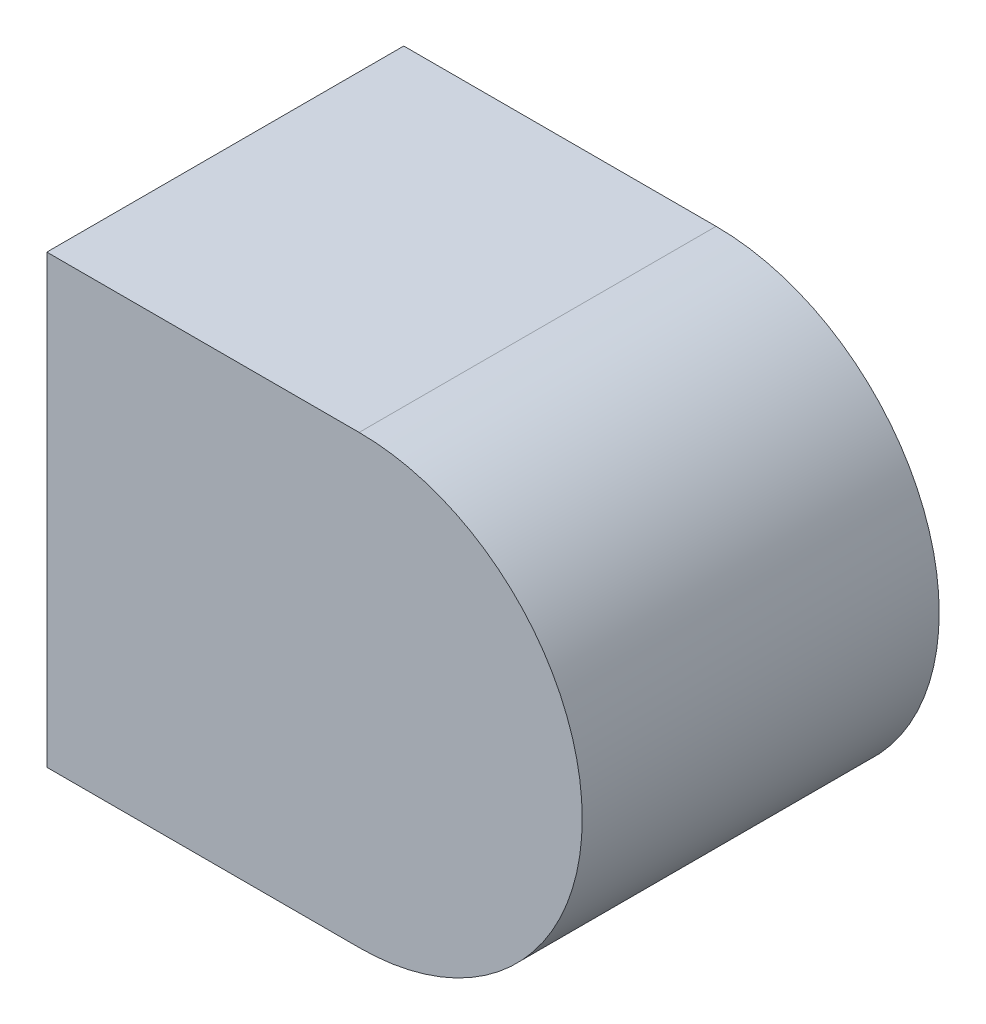
ISO-10303-21;
HEADER;
FILE_DESCRIPTION(('STEP AP214'),'2;1');
FILE_NAME('part.step','',(''),(''),'','','');
FILE_SCHEMA(('AUTOMOTIVE_DESIGN { 1 0 10303 214 1 1 1 1 }'));
ENDSEC;
DATA;
#1=APPLICATION_CONTEXT('core data for automotive mechanical design processes');
#2=APPLICATION_PROTOCOL_DEFINITION('international standard','automotive_design',2000,#1);
#3=PRODUCT_CONTEXT('',#1,'mechanical');
#4=PRODUCT('Part','Part','',(#3));
#5=PRODUCT_RELATED_PRODUCT_CATEGORY('part','',(#4));
#6=PRODUCT_DEFINITION_FORMATION('','',#4);
#7=PRODUCT_DEFINITION_CONTEXT('part definition',#1,'design');
#8=PRODUCT_DEFINITION('design','',#6,#7);
#9=PRODUCT_DEFINITION_SHAPE('','',#8);
#10=(LENGTH_UNIT() NAMED_UNIT(*) SI_UNIT(.MILLI.,.METRE.));
#11=(NAMED_UNIT(*) PLANE_ANGLE_UNIT() SI_UNIT($,.RADIAN.));
#12=(NAMED_UNIT(*) SI_UNIT($,.STERADIAN.) SOLID_ANGLE_UNIT());
#13=UNCERTAINTY_MEASURE_WITH_UNIT(LENGTH_MEASURE(1.E-05),#10,'distance_accuracy_value','');
#14=(GEOMETRIC_REPRESENTATION_CONTEXT(3) GLOBAL_UNCERTAINTY_ASSIGNED_CONTEXT((#13)) GLOBAL_UNIT_ASSIGNED_CONTEXT((#10,
#11,#12)) REPRESENTATION_CONTEXT('',''));
#15=CARTESIAN_POINT('',(0.,0.,0.));
#16=DIRECTION('',(0.,0.,1.));
#17=DIRECTION('',(1.,0.,0.));
#18=AXIS2_PLACEMENT_3D('',#15,#16,#17);
#19=CARTESIAN_POINT('',(-0.703,-0.125,0.));
#20=DIRECTION('',(0.,1.,0.));
#21=DIRECTION('',(-1.,0.,0.));
#22=AXIS2_PLACEMENT_3D('',#19,#20,#21);
#23=PLANE('',#22);
#24=DIRECTION('',(0.,0.,1.));
#25=VECTOR('',#24,1.);
#26=CARTESIAN_POINT('',(-0.828,-0.125,0.));
#27=LINE('',#26,#25);
#28=CARTESIAN_POINT('',(-0.828,-0.125,0.));
#29=VERTEX_POINT('',#28);
#30=CARTESIAN_POINT('',(-0.828,-0.125,0.2));
#31=VERTEX_POINT('',#30);
#32=EDGE_CURVE('E11',#29,#31,#27,.T.);
#33=ORIENTED_EDGE('',*,*,#32,.F.);
#34=DIRECTION('',(-1.,0.,0.));
#35=VECTOR('',#34,1.);
#36=CARTESIAN_POINT('',(-0.703,-0.125,0.));
#37=LINE('',#36,#35);
#38=CARTESIAN_POINT('',(-1.003,-0.125,0.));
#39=VERTEX_POINT('',#38);
#40=EDGE_CURVE('E24',#29,#39,#37,.T.);
#41=ORIENTED_EDGE('',*,*,#40,.T.);
#42=DIRECTION('',(0.,0.,1.));
#43=VECTOR('',#42,1.);
#44=CARTESIAN_POINT('',(-1.003,-0.125,0.));
#45=LINE('',#44,#43);
#46=CARTESIAN_POINT('',(-1.003,-0.125,0.2));
#47=VERTEX_POINT('',#46);
#48=EDGE_CURVE('E88',#39,#47,#45,.T.);
#49=ORIENTED_EDGE('',*,*,#48,.T.);
#50=DIRECTION('',(-1.,0.,0.));
#51=VECTOR('',#50,1.);
#52=CARTESIAN_POINT('',(-0.703,-0.125,0.2));
#53=LINE('',#52,#51);
#54=EDGE_CURVE('E76',#31,#47,#53,.T.);
#55=ORIENTED_EDGE('',*,*,#54,.F.);
#56=EDGE_LOOP('',(#33,#41,#49,#55));
#57=FACE_BOUND('',#56,.T.);
#58=ADVANCED_FACE('F17',(#57),#23,.T.);
#59=CARTESIAN_POINT('',(-0.852999999999999,-0.25,0.));
#60=DIRECTION('',(0.,0.,1.));
#61=DIRECTION('',(1.,0.,0.));
#62=AXIS2_PLACEMENT_3D('',#59,#60,#61);
#63=PLANE('',#62);
#64=CARTESIAN_POINT('',(-0.828,-0.25,0.));
#65=DIRECTION('',(0.,0.,1.));
#66=DIRECTION('',(0.707106781186548,0.707106781186547,0.));
#67=AXIS2_PLACEMENT_3D('',#64,#65,#66);
#68=CIRCLE('',#67,0.125);
#69=CARTESIAN_POINT('',(-0.828,-0.375,0.));
#70=VERTEX_POINT('',#69);
#71=EDGE_CURVE('E85',#70,#29,#68,.T.);
#72=ORIENTED_EDGE('',*,*,#71,.F.);
#73=DIRECTION('',(1.,0.,0.));
#74=VECTOR('',#73,1.);
#75=CARTESIAN_POINT('',(-1.003,-0.375,0.));
#76=LINE('',#75,#74);
#77=CARTESIAN_POINT('',(-1.003,-0.375,0.));
#78=VERTEX_POINT('',#77);
#79=EDGE_CURVE('E83',#78,#70,#76,.T.);
#80=ORIENTED_EDGE('',*,*,#79,.F.);
#81=DIRECTION('',(0.,-1.,0.));
#82=VECTOR('',#81,1.);
#83=CARTESIAN_POINT('',(-1.003,-0.125,0.));
#84=LINE('',#83,#82);
#85=EDGE_CURVE('E72',#39,#78,#84,.T.);
#86=ORIENTED_EDGE('',*,*,#85,.F.);
#87=ORIENTED_EDGE('',*,*,#40,.F.);
#88=EDGE_LOOP('',(#72,#80,#86,#87));
#89=FACE_BOUND('',#88,.T.);
#90=ADVANCED_FACE('F90',(#89),#63,.F.);
#91=CARTESIAN_POINT('',(-0.828,-0.25,0.));
#92=DIRECTION('',(0.,0.,1.));
#93=DIRECTION('',(0.707106781186547,-0.707106781186548,0.));
#94=AXIS2_PLACEMENT_3D('',#91,#92,#93);
#95=CYLINDRICAL_SURFACE('',#94,0.125);
#96=CARTESIAN_POINT('',(-0.828,-0.25,0.2));
#97=DIRECTION('',(0.,0.,-1.));
#98=DIRECTION('',(0.707106781186548,0.707106781186547,0.));
#99=AXIS2_PLACEMENT_3D('',#96,#97,#98);
#100=CIRCLE('',#99,0.125);
#101=CARTESIAN_POINT('',(-0.828,-0.375,0.2));
#102=VERTEX_POINT('',#101);
#103=EDGE_CURVE('E80',#31,#102,#100,.T.);
#104=ORIENTED_EDGE('',*,*,#103,.T.);
#105=DIRECTION('',(0.,0.,-1.));
#106=VECTOR('',#105,1.);
#107=CARTESIAN_POINT('',(-0.828,-0.375,0.));
#108=LINE('',#107,#106);
#109=EDGE_CURVE('E60',#102,#70,#108,.T.);
#110=ORIENTED_EDGE('',*,*,#109,.T.);
#111=ORIENTED_EDGE('',*,*,#71,.T.);
#112=ORIENTED_EDGE('',*,*,#32,.T.);
#113=EDGE_LOOP('',(#104,#110,#111,#112));
#114=FACE_BOUND('',#113,.T.);
#115=ADVANCED_FACE('F91',(#114),#95,.T.);
#116=CARTESIAN_POINT('',(-1.003,-0.375,0.));
#117=DIRECTION('',(0.,-1.,0.));
#118=DIRECTION('',(1.,0.,0.));
#119=AXIS2_PLACEMENT_3D('',#116,#117,#118);
#120=PLANE('',#119);
#121=ORIENTED_EDGE('',*,*,#109,.F.);
#122=DIRECTION('',(1.,0.,0.));
#123=VECTOR('',#122,1.);
#124=CARTESIAN_POINT('',(-1.003,-0.375,0.2));
#125=LINE('',#124,#123);
#126=CARTESIAN_POINT('',(-1.003,-0.375,0.2));
#127=VERTEX_POINT('',#126);
#128=EDGE_CURVE('E54',#127,#102,#125,.T.);
#129=ORIENTED_EDGE('',*,*,#128,.F.);
#130=DIRECTION('',(0.,0.,1.));
#131=VECTOR('',#130,1.);
#132=CARTESIAN_POINT('',(-1.003,-0.375,0.));
#133=LINE('',#132,#131);
#134=EDGE_CURVE('E58',#78,#127,#133,.T.);
#135=ORIENTED_EDGE('',*,*,#134,.F.);
#136=ORIENTED_EDGE('',*,*,#79,.T.);
#137=EDGE_LOOP('',(#121,#129,#135,#136));
#138=FACE_BOUND('',#137,.T.);
#139=ADVANCED_FACE('F56',(#138),#120,.T.);
#140=CARTESIAN_POINT('',(-1.003,-0.125,0.));
#141=DIRECTION('',(-1.,0.,0.));
#142=DIRECTION('',(0.,-1.,0.));
#143=AXIS2_PLACEMENT_3D('',#140,#141,#142);
#144=PLANE('',#143);
#145=ORIENTED_EDGE('',*,*,#85,.T.);
#146=ORIENTED_EDGE('',*,*,#134,.T.);
#147=DIRECTION('',(0.,-1.,0.));
#148=VECTOR('',#147,1.);
#149=CARTESIAN_POINT('',(-1.003,-0.125,0.2));
#150=LINE('',#149,#148);
#151=EDGE_CURVE('E70',#47,#127,#150,.T.);
#152=ORIENTED_EDGE('',*,*,#151,.F.);
#153=ORIENTED_EDGE('',*,*,#48,.F.);
#154=EDGE_LOOP('',(#145,#146,#152,#153));
#155=FACE_BOUND('',#154,.T.);
#156=ADVANCED_FACE('F68',(#155),#144,.T.);
#157=CARTESIAN_POINT('',(-0.852999999999999,-0.25,0.2));
#158=DIRECTION('',(0.,0.,1.));
#159=DIRECTION('',(1.,0.,0.));
#160=AXIS2_PLACEMENT_3D('',#157,#158,#159);
#161=PLANE('',#160);
#162=ORIENTED_EDGE('',*,*,#103,.F.);
#163=ORIENTED_EDGE('',*,*,#54,.T.);
#164=ORIENTED_EDGE('',*,*,#151,.T.);
#165=ORIENTED_EDGE('',*,*,#128,.T.);
#166=EDGE_LOOP('',(#162,#163,#164,#165));
#167=FACE_BOUND('',#166,.T.);
#168=ADVANCED_FACE('F75',(#167),#161,.T.);
#169=CLOSED_SHELL('',(#58,#90,#115,#139,#156,#168));
#170=MANIFOLD_SOLID_BREP('B1',#169);
#171=ADVANCED_BREP_SHAPE_REPRESENTATION('',(#18,#170),#14);
#172=SHAPE_DEFINITION_REPRESENTATION(#9,#171);
ENDSEC;
END-ISO-10303-21;
